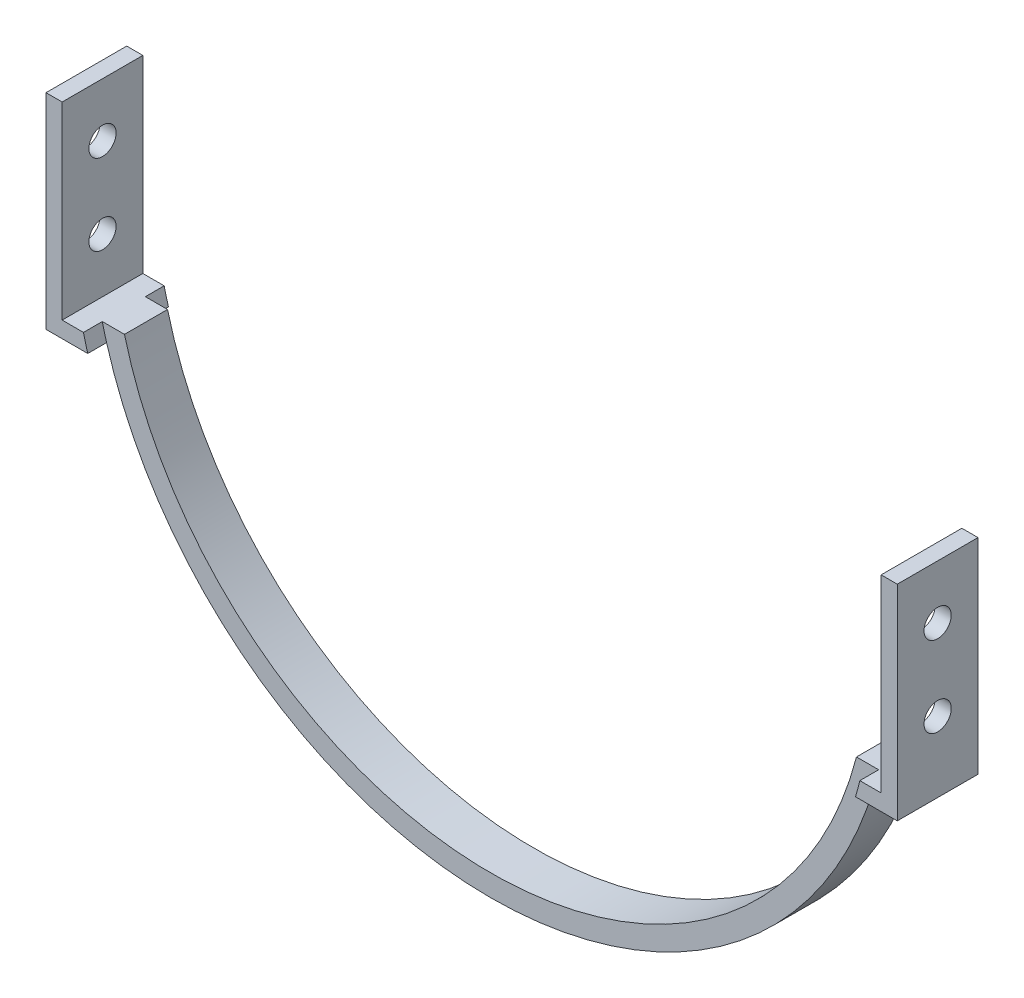
ISO-10303-21;
HEADER;
FILE_DESCRIPTION(('STEP AP214'),'2;1');
FILE_NAME('part.step','',(''),(''),'','','');
FILE_SCHEMA(('AUTOMOTIVE_DESIGN { 1 0 10303 214 1 1 1 1 }'));
ENDSEC;
DATA;
#1=APPLICATION_CONTEXT('core data for automotive mechanical design processes');
#2=APPLICATION_PROTOCOL_DEFINITION('international standard','automotive_design',2000,#1);
#3=PRODUCT_CONTEXT('',#1,'mechanical');
#4=PRODUCT('Part','Part','',(#3));
#5=PRODUCT_RELATED_PRODUCT_CATEGORY('part','',(#4));
#6=PRODUCT_DEFINITION_FORMATION('','',#4);
#7=PRODUCT_DEFINITION_CONTEXT('part definition',#1,'design');
#8=PRODUCT_DEFINITION('design','',#6,#7);
#9=PRODUCT_DEFINITION_SHAPE('','',#8);
#10=(LENGTH_UNIT() NAMED_UNIT(*) SI_UNIT(.MILLI.,.METRE.));
#11=(NAMED_UNIT(*) PLANE_ANGLE_UNIT() SI_UNIT($,.RADIAN.));
#12=(NAMED_UNIT(*) SI_UNIT($,.STERADIAN.) SOLID_ANGLE_UNIT());
#13=UNCERTAINTY_MEASURE_WITH_UNIT(LENGTH_MEASURE(1.E-05),#10,'distance_accuracy_value','');
#14=(GEOMETRIC_REPRESENTATION_CONTEXT(3) GLOBAL_UNCERTAINTY_ASSIGNED_CONTEXT((#13)) GLOBAL_UNIT_ASSIGNED_CONTEXT((#10,
#11,#12)) REPRESENTATION_CONTEXT('',''));
#15=CARTESIAN_POINT('',(0.,0.,0.));
#16=DIRECTION('',(0.,0.,1.));
#17=DIRECTION('',(1.,0.,0.));
#18=AXIS2_PLACEMENT_3D('',#15,#16,#17);
#19=CARTESIAN_POINT('',(-79.1,0.,7.5));
#20=DIRECTION('',(1.,0.,0.));
#21=DIRECTION('',(0.,0.,-1.));
#22=AXIS2_PLACEMENT_3D('',#19,#20,#21);
#23=PLANE('',#22);
#24=CARTESIAN_POINT('',(-79.1,7.5,0.));
#25=DIRECTION('',(-1.,0.,0.));
#26=DIRECTION('',(0.,0.,1.));
#27=AXIS2_PLACEMENT_3D('',#24,#25,#26);
#28=CIRCLE('',#27,2.5273);
#29=CARTESIAN_POINT('',(-79.1,7.5,2.5273));
#30=VERTEX_POINT('',#29);
#31=EDGE_CURVE('E367',#30,#30,#28,.T.);
#32=ORIENTED_EDGE('',*,*,#31,.F.);
#33=EDGE_LOOP('',(#32));
#34=FACE_BOUND('',#33,.T.);
#35=DIRECTION('',(0.,-1.,0.));
#36=VECTOR('',#35,1.);
#37=CARTESIAN_POINT('',(-79.1,0.,-7.5));
#38=LINE('',#37,#36);
#39=CARTESIAN_POINT('',(-79.1,17.5,-7.5));
#40=VERTEX_POINT('',#39);
#41=CARTESIAN_POINT('',(-79.1,-20.6,-7.5));
#42=VERTEX_POINT('',#41);
#43=EDGE_CURVE('E296',#40,#42,#38,.T.);
#44=ORIENTED_EDGE('',*,*,#43,.T.);
#45=DIRECTION('',(0.,0.,-1.));
#46=VECTOR('',#45,1.);
#47=CARTESIAN_POINT('',(-79.1,-20.6,7.5));
#48=LINE('',#47,#46);
#49=CARTESIAN_POINT('',(-79.1,-20.6,7.5));
#50=VERTEX_POINT('',#49);
#51=EDGE_CURVE('E306',#50,#42,#48,.T.);
#52=ORIENTED_EDGE('',*,*,#51,.F.);
#53=DIRECTION('',(0.,-1.,0.));
#54=VECTOR('',#53,1.);
#55=CARTESIAN_POINT('',(-79.1,0.,7.5));
#56=LINE('',#55,#54);
#57=CARTESIAN_POINT('',(-79.1,17.5,7.5));
#58=VERTEX_POINT('',#57);
#59=EDGE_CURVE('E277',#58,#50,#56,.T.);
#60=ORIENTED_EDGE('',*,*,#59,.F.);
#61=DIRECTION('',(0.,0.,-1.));
#62=VECTOR('',#61,1.);
#63=CARTESIAN_POINT('',(-79.1,17.5,7.5));
#64=LINE('',#63,#62);
#65=EDGE_CURVE('E311',#58,#40,#64,.T.);
#66=ORIENTED_EDGE('',*,*,#65,.T.);
#67=EDGE_LOOP('',(#44,#52,#60,#66));
#68=FACE_BOUND('',#67,.T.);
#69=CARTESIAN_POINT('',(-79.1,-7.5,0.));
#70=DIRECTION('',(-1.,0.,0.));
#71=DIRECTION('',(0.,0.,1.));
#72=AXIS2_PLACEMENT_3D('',#69,#70,#71);
#73=CIRCLE('',#72,2.5273);
#74=CARTESIAN_POINT('',(-79.1,-7.5,2.5273));
#75=VERTEX_POINT('',#74);
#76=EDGE_CURVE('E366',#75,#75,#73,.T.);
#77=ORIENTED_EDGE('',*,*,#76,.F.);
#78=EDGE_LOOP('',(#77));
#79=FACE_BOUND('',#78,.T.);
#80=ADVANCED_FACE('F49',(#34,#68,#79),#23,.F.);
#81=CARTESIAN_POINT('',(0.,0.,4.));
#82=DIRECTION('',(0.,0.,-1.));
#83=DIRECTION('',(-1.,0.,0.));
#84=AXIS2_PLACEMENT_3D('',#81,#82,#83);
#85=CYLINDRICAL_SURFACE('',#84,74.255);
#86=CARTESIAN_POINT('',(0.,0.,-4.));
#87=DIRECTION('',(0.,0.,1.));
#88=DIRECTION('',(1.,0.,0.));
#89=AXIS2_PLACEMENT_3D('',#86,#87,#88);
#90=CIRCLE('',#89,74.255);
#91=CARTESIAN_POINT('',(-71.3403464037006,-20.6,-4.));
#92=VERTEX_POINT('',#91);
#93=CARTESIAN_POINT('',(71.3403464037006,-20.6,-4.));
#94=VERTEX_POINT('',#93);
#95=EDGE_CURVE('E349',#92,#94,#90,.T.);
#96=ORIENTED_EDGE('',*,*,#95,.T.);
#97=DIRECTION('',(0.,0.,-1.));
#98=VECTOR('',#97,1.);
#99=CARTESIAN_POINT('',(71.3403464037006,-20.6,7.5));
#100=LINE('',#99,#98);
#101=CARTESIAN_POINT('',(71.3403464037006,-20.6,4.));
#102=VERTEX_POINT('',#101);
#103=EDGE_CURVE('E67',#102,#94,#100,.T.);
#104=ORIENTED_EDGE('',*,*,#103,.F.);
#105=CARTESIAN_POINT('',(0.,0.,4.));
#106=DIRECTION('',(0.,0.,1.));
#107=DIRECTION('',(1.,0.,0.));
#108=AXIS2_PLACEMENT_3D('',#105,#106,#107);
#109=CIRCLE('',#108,74.255);
#110=CARTESIAN_POINT('',(-71.3403464037006,-20.6,4.));
#111=VERTEX_POINT('',#110);
#112=EDGE_CURVE('E333',#111,#102,#109,.T.);
#113=ORIENTED_EDGE('',*,*,#112,.F.);
#114=DIRECTION('',(0.,0.,-1.));
#115=VECTOR('',#114,1.);
#116=CARTESIAN_POINT('',(-71.3403464037006,-20.6,7.5));
#117=LINE('',#116,#115);
#118=EDGE_CURVE('E307',#111,#92,#117,.T.);
#119=ORIENTED_EDGE('',*,*,#118,.T.);
#120=EDGE_LOOP('',(#96,#104,#113,#119));
#121=FACE_BOUND('',#120,.T.);
#122=ADVANCED_FACE('F51',(#121),#85,.T.);
#123=CARTESIAN_POINT('',(0.,-17.6,4.));
#124=DIRECTION('',(0.,-1.,0.));
#125=DIRECTION('',(0.,0.,-1.));
#126=AXIS2_PLACEMENT_3D('',#123,#124,#125);
#127=PLANE('',#126);
#128=DIRECTION('',(-1.,0.,0.));
#129=VECTOR('',#128,1.);
#130=CARTESIAN_POINT('',(0.,-17.6,-4.));
#131=LINE('',#130,#129);
#132=CARTESIAN_POINT('',(72.1390672590102,-17.6,-4.));
#133=VERTEX_POINT('',#132);
#134=CARTESIAN_POINT('',(68.0147412330591,-17.6,-4.));
#135=VERTEX_POINT('',#134);
#136=EDGE_CURVE('E348',#133,#135,#131,.T.);
#137=ORIENTED_EDGE('',*,*,#136,.T.);
#138=DIRECTION('',(0.,0.,-1.));
#139=VECTOR('',#138,1.);
#140=CARTESIAN_POINT('',(68.0147412330591,-17.6,4.));
#141=LINE('',#140,#139);
#142=CARTESIAN_POINT('',(68.0147412330591,-17.6,4.));
#143=VERTEX_POINT('',#142);
#144=EDGE_CURVE('E11',#143,#135,#141,.T.);
#145=ORIENTED_EDGE('',*,*,#144,.F.);
#146=DIRECTION('',(-1.,0.,0.));
#147=VECTOR('',#146,1.);
#148=CARTESIAN_POINT('',(0.,-17.6,4.));
#149=LINE('',#148,#147);
#150=CARTESIAN_POINT('',(72.1390672590102,-17.6,4.));
#151=VERTEX_POINT('',#150);
#152=EDGE_CURVE('E332',#151,#143,#149,.T.);
#153=ORIENTED_EDGE('',*,*,#152,.F.);
#154=DIRECTION('',(0.,0.,-1.));
#155=VECTOR('',#154,1.);
#156=CARTESIAN_POINT('',(72.1390672590102,-17.6,7.5));
#157=LINE('',#156,#155);
#158=CARTESIAN_POINT('',(72.1390672590102,-17.6,7.5));
#159=VERTEX_POINT('',#158);
#160=EDGE_CURVE('E246',#159,#151,#157,.T.);
#161=ORIENTED_EDGE('',*,*,#160,.F.);
#162=DIRECTION('',(1.,0.,0.));
#163=VECTOR('',#162,1.);
#164=CARTESIAN_POINT('',(0.,-17.6,7.5));
#165=LINE('',#164,#163);
#166=CARTESIAN_POINT('',(76.1,-17.6,7.5));
#167=VERTEX_POINT('',#166);
#168=EDGE_CURVE('E197',#159,#167,#165,.T.);
#169=ORIENTED_EDGE('',*,*,#168,.T.);
#170=DIRECTION('',(0.,0.,-1.));
#171=VECTOR('',#170,1.);
#172=CARTESIAN_POINT('',(76.1,-17.6,7.5));
#173=LINE('',#172,#171);
#174=CARTESIAN_POINT('',(76.1,-17.6,-7.5));
#175=VERTEX_POINT('',#174);
#176=EDGE_CURVE('E249',#167,#175,#173,.T.);
#177=ORIENTED_EDGE('',*,*,#176,.T.);
#178=DIRECTION('',(1.,0.,0.));
#179=VECTOR('',#178,1.);
#180=CARTESIAN_POINT('',(0.,-17.6,-7.5));
#181=LINE('',#180,#179);
#182=CARTESIAN_POINT('',(72.1390672590102,-17.6,-7.5));
#183=VERTEX_POINT('',#182);
#184=EDGE_CURVE('E199',#183,#175,#181,.T.);
#185=ORIENTED_EDGE('',*,*,#184,.F.);
#186=EDGE_CURVE('E221',#133,#183,#157,.T.);
#187=ORIENTED_EDGE('',*,*,#186,.F.);
#188=EDGE_LOOP('',(#137,#145,#153,#161,#169,#177,#185,#187));
#189=FACE_BOUND('',#188,.T.);
#190=ADVANCED_FACE('F419',(#189),#127,.F.);
#191=CARTESIAN_POINT('',(0.,0.,4.));
#192=DIRECTION('',(0.,0.,-1.));
#193=DIRECTION('',(-1.,0.,0.));
#194=AXIS2_PLACEMENT_3D('',#191,#192,#193);
#195=CYLINDRICAL_SURFACE('',#194,70.255);
#196=CARTESIAN_POINT('',(0.,0.,-4.));
#197=DIRECTION('',(0.,0.,1.));
#198=DIRECTION('',(1.,0.,0.));
#199=AXIS2_PLACEMENT_3D('',#196,#197,#198);
#200=CIRCLE('',#199,70.255);
#201=CARTESIAN_POINT('',(-68.0147412330592,-17.6,-4.));
#202=VERTEX_POINT('',#201);
#203=EDGE_CURVE('E353',#202,#135,#200,.T.);
#204=ORIENTED_EDGE('',*,*,#203,.F.);
#205=DIRECTION('',(0.,0.,-1.));
#206=VECTOR('',#205,1.);
#207=CARTESIAN_POINT('',(-68.0147412330592,-17.6,4.));
#208=LINE('',#207,#206);
#209=CARTESIAN_POINT('',(-68.0147412330592,-17.6,4.));
#210=VERTEX_POINT('',#209);
#211=EDGE_CURVE('E59',#210,#202,#208,.T.);
#212=ORIENTED_EDGE('',*,*,#211,.F.);
#213=CARTESIAN_POINT('',(0.,0.,4.));
#214=DIRECTION('',(0.,0.,1.));
#215=DIRECTION('',(1.,0.,0.));
#216=AXIS2_PLACEMENT_3D('',#213,#214,#215);
#217=CIRCLE('',#216,70.255);
#218=EDGE_CURVE('E336',#210,#143,#217,.T.);
#219=ORIENTED_EDGE('',*,*,#218,.T.);
#220=ORIENTED_EDGE('',*,*,#144,.T.);
#221=EDGE_LOOP('',(#204,#212,#219,#220));
#222=FACE_BOUND('',#221,.T.);
#223=ADVANCED_FACE('F447',(#222),#195,.F.);
#224=CARTESIAN_POINT('',(0.,-17.6,4.));
#225=DIRECTION('',(0.,1.,0.));
#226=DIRECTION('',(0.,0.,1.));
#227=AXIS2_PLACEMENT_3D('',#224,#225,#226);
#228=PLANE('',#227);
#229=DIRECTION('',(1.,0.,0.));
#230=VECTOR('',#229,1.);
#231=CARTESIAN_POINT('',(0.,-17.6,-4.));
#232=LINE('',#231,#230);
#233=CARTESIAN_POINT('',(-72.1390672590102,-17.6,-4.));
#234=VERTEX_POINT('',#233);
#235=EDGE_CURVE('E357',#234,#202,#232,.T.);
#236=ORIENTED_EDGE('',*,*,#235,.F.);
#237=DIRECTION('',(0.,0.,-1.));
#238=VECTOR('',#237,1.);
#239=CARTESIAN_POINT('',(-72.1390672590102,-17.6,7.5));
#240=LINE('',#239,#238);
#241=CARTESIAN_POINT('',(-72.1390672590102,-17.6,-7.5));
#242=VERTEX_POINT('',#241);
#243=EDGE_CURVE('E323',#234,#242,#240,.T.);
#244=ORIENTED_EDGE('',*,*,#243,.T.);
#245=DIRECTION('',(-1.,0.,0.));
#246=VECTOR('',#245,1.);
#247=CARTESIAN_POINT('',(0.,-17.6,-7.5));
#248=LINE('',#247,#246);
#249=CARTESIAN_POINT('',(-76.1,-17.6,-7.5));
#250=VERTEX_POINT('',#249);
#251=EDGE_CURVE('E287',#242,#250,#248,.T.);
#252=ORIENTED_EDGE('',*,*,#251,.T.);
#253=DIRECTION('',(0.,0.,-1.));
#254=VECTOR('',#253,1.);
#255=CARTESIAN_POINT('',(-76.1,-17.6,7.5));
#256=LINE('',#255,#254);
#257=CARTESIAN_POINT('',(-76.1,-17.6,7.5));
#258=VERTEX_POINT('',#257);
#259=EDGE_CURVE('E319',#258,#250,#256,.T.);
#260=ORIENTED_EDGE('',*,*,#259,.F.);
#261=DIRECTION('',(-1.,0.,0.));
#262=VECTOR('',#261,1.);
#263=CARTESIAN_POINT('',(0.,-17.6,7.5));
#264=LINE('',#263,#262);
#265=CARTESIAN_POINT('',(-72.1390672590102,-17.6,7.5));
#266=VERTEX_POINT('',#265);
#267=EDGE_CURVE('E267',#266,#258,#264,.T.);
#268=ORIENTED_EDGE('',*,*,#267,.F.);
#269=CARTESIAN_POINT('',(-72.1390672590102,-17.6,4.));
#270=VERTEX_POINT('',#269);
#271=EDGE_CURVE('E324',#266,#270,#240,.T.);
#272=ORIENTED_EDGE('',*,*,#271,.T.);
#273=DIRECTION('',(1.,0.,0.));
#274=VECTOR('',#273,1.);
#275=CARTESIAN_POINT('',(0.,-17.6,4.));
#276=LINE('',#275,#274);
#277=EDGE_CURVE('E340',#270,#210,#276,.T.);
#278=ORIENTED_EDGE('',*,*,#277,.T.);
#279=ORIENTED_EDGE('',*,*,#211,.T.);
#280=EDGE_LOOP('',(#236,#244,#252,#260,#268,#272,#278,#279));
#281=FACE_BOUND('',#280,.T.);
#282=ADVANCED_FACE('F441',(#281),#228,.T.);
#283=CARTESIAN_POINT('',(0.,0.,4.));
#284=DIRECTION('',(0.,0.,1.));
#285=DIRECTION('',(1.,0.,0.));
#286=AXIS2_PLACEMENT_3D('',#283,#284,#285);
#287=PLANE('',#286);
#288=EDGE_CURVE('E328',#270,#111,#109,.T.);
#289=ORIENTED_EDGE('',*,*,#288,.T.);
#290=ORIENTED_EDGE('',*,*,#112,.T.);
#291=CARTESIAN_POINT('',(0.,0.,4.));
#292=DIRECTION('',(0.,0.,1.));
#293=DIRECTION('',(1.,0.,0.));
#294=AXIS2_PLACEMENT_3D('',#291,#292,#293);
#295=CIRCLE('',#294,74.255);
#296=EDGE_CURVE('E183',#151,#102,#295,.F.);
#297=ORIENTED_EDGE('',*,*,#296,.F.);
#298=ORIENTED_EDGE('',*,*,#152,.T.);
#299=ORIENTED_EDGE('',*,*,#218,.F.);
#300=ORIENTED_EDGE('',*,*,#277,.F.);
#301=EDGE_LOOP('',(#289,#290,#297,#298,#299,#300));
#302=FACE_BOUND('',#301,.T.);
#303=ADVANCED_FACE('F437',(#302),#287,.T.);
#304=CARTESIAN_POINT('',(0.,0.,-4.));
#305=DIRECTION('',(0.,0.,1.));
#306=DIRECTION('',(1.,0.,0.));
#307=AXIS2_PLACEMENT_3D('',#304,#305,#306);
#308=PLANE('',#307);
#309=EDGE_CURVE('E344',#234,#92,#90,.T.);
#310=ORIENTED_EDGE('',*,*,#309,.F.);
#311=ORIENTED_EDGE('',*,*,#235,.T.);
#312=ORIENTED_EDGE('',*,*,#203,.T.);
#313=ORIENTED_EDGE('',*,*,#136,.F.);
#314=EDGE_CURVE('E75',#94,#133,#90,.T.);
#315=ORIENTED_EDGE('',*,*,#314,.F.);
#316=ORIENTED_EDGE('',*,*,#95,.F.);
#317=EDGE_LOOP('',(#310,#311,#312,#313,#315,#316));
#318=FACE_BOUND('',#317,.T.);
#319=ADVANCED_FACE('F440',(#318),#308,.F.);
#320=CARTESIAN_POINT('',(0.,0.,7.5));
#321=DIRECTION('',(0.,0.,-1.));
#322=DIRECTION('',(-1.,0.,0.));
#323=AXIS2_PLACEMENT_3D('',#320,#321,#322);
#324=CYLINDRICAL_SURFACE('',#323,74.255);
#325=ORIENTED_EDGE('',*,*,#309,.T.);
#326=CARTESIAN_POINT('',(-71.3403464037006,-20.6,-7.5));
#327=VERTEX_POINT('',#326);
#328=EDGE_CURVE('E283',#92,#327,#117,.T.);
#329=ORIENTED_EDGE('',*,*,#328,.T.);
#330=CARTESIAN_POINT('',(0.,0.,-7.5));
#331=DIRECTION('',(0.,0.,1.));
#332=DIRECTION('',(1.,0.,0.));
#333=AXIS2_PLACEMENT_3D('',#330,#331,#332);
#334=CIRCLE('',#333,74.255);
#335=EDGE_CURVE('E262',#242,#327,#334,.T.);
#336=ORIENTED_EDGE('',*,*,#335,.F.);
#337=ORIENTED_EDGE('',*,*,#243,.F.);
#338=EDGE_LOOP('',(#325,#329,#336,#337));
#339=FACE_BOUND('',#338,.T.);
#340=ADVANCED_FACE('F435',(#339),#324,.F.);
#341=CARTESIAN_POINT('',(-71.3403464037006,-20.6,7.5));
#342=VERTEX_POINT('',#341);
#343=EDGE_CURVE('E302',#342,#111,#117,.T.);
#344=ORIENTED_EDGE('',*,*,#343,.T.);
#345=ORIENTED_EDGE('',*,*,#288,.F.);
#346=ORIENTED_EDGE('',*,*,#271,.F.);
#347=CARTESIAN_POINT('',(0.,0.,7.5));
#348=DIRECTION('',(0.,0.,1.));
#349=DIRECTION('',(1.,0.,0.));
#350=AXIS2_PLACEMENT_3D('',#347,#348,#349);
#351=CIRCLE('',#350,74.255);
#352=EDGE_CURVE('E263',#266,#342,#351,.T.);
#353=ORIENTED_EDGE('',*,*,#352,.T.);
#354=EDGE_LOOP('',(#344,#345,#346,#353));
#355=FACE_BOUND('',#354,.T.);
#356=ADVANCED_FACE('F431',(#355),#324,.F.);
#357=CARTESIAN_POINT('',(-76.1,0.,7.5));
#358=DIRECTION('',(-1.,0.,0.));
#359=DIRECTION('',(0.,0.,1.));
#360=AXIS2_PLACEMENT_3D('',#357,#358,#359);
#361=PLANE('',#360);
#362=CARTESIAN_POINT('',(-76.1,7.5,0.));
#363=DIRECTION('',(-1.,0.,0.));
#364=DIRECTION('',(0.,0.,1.));
#365=AXIS2_PLACEMENT_3D('',#362,#363,#364);
#366=CIRCLE('',#365,2.5273);
#367=CARTESIAN_POINT('',(-76.1,7.5,2.5273));
#368=VERTEX_POINT('',#367);
#369=EDGE_CURVE('E363',#368,#368,#366,.T.);
#370=ORIENTED_EDGE('',*,*,#369,.T.);
#371=EDGE_LOOP('',(#370));
#372=FACE_BOUND('',#371,.T.);
#373=CARTESIAN_POINT('',(-76.1,-7.5,0.));
#374=DIRECTION('',(-1.,0.,0.));
#375=DIRECTION('',(0.,0.,1.));
#376=AXIS2_PLACEMENT_3D('',#373,#374,#375);
#377=CIRCLE('',#376,2.5273);
#378=CARTESIAN_POINT('',(-76.1,-7.5,2.5273));
#379=VERTEX_POINT('',#378);
#380=EDGE_CURVE('E227',#379,#379,#377,.T.);
#381=ORIENTED_EDGE('',*,*,#380,.T.);
#382=EDGE_LOOP('',(#381));
#383=FACE_BOUND('',#382,.T.);
#384=DIRECTION('',(0.,1.,0.));
#385=VECTOR('',#384,1.);
#386=CARTESIAN_POINT('',(-76.1,0.,-7.5));
#387=LINE('',#386,#385);
#388=CARTESIAN_POINT('',(-76.1,17.5,-7.5));
#389=VERTEX_POINT('',#388);
#390=EDGE_CURVE('E290',#250,#389,#387,.T.);
#391=ORIENTED_EDGE('',*,*,#390,.T.);
#392=DIRECTION('',(0.,0.,-1.));
#393=VECTOR('',#392,1.);
#394=CARTESIAN_POINT('',(-76.1,17.5,7.5));
#395=LINE('',#394,#393);
#396=CARTESIAN_POINT('',(-76.1,17.5,7.5));
#397=VERTEX_POINT('',#396);
#398=EDGE_CURVE('E315',#397,#389,#395,.T.);
#399=ORIENTED_EDGE('',*,*,#398,.F.);
#400=DIRECTION('',(0.,1.,0.));
#401=VECTOR('',#400,1.);
#402=CARTESIAN_POINT('',(-76.1,0.,7.5));
#403=LINE('',#402,#401);
#404=EDGE_CURVE('E271',#258,#397,#403,.T.);
#405=ORIENTED_EDGE('',*,*,#404,.F.);
#406=ORIENTED_EDGE('',*,*,#259,.T.);
#407=EDGE_LOOP('',(#391,#399,#405,#406));
#408=FACE_BOUND('',#407,.T.);
#409=ADVANCED_FACE('F393',(#372,#383,#408),#361,.F.);
#410=CARTESIAN_POINT('',(0.,17.5,7.5));
#411=DIRECTION('',(0.,-1.,0.));
#412=DIRECTION('',(0.,0.,-1.));
#413=AXIS2_PLACEMENT_3D('',#410,#411,#412);
#414=PLANE('',#413);
#415=DIRECTION('',(-1.,0.,0.));
#416=VECTOR('',#415,1.);
#417=CARTESIAN_POINT('',(0.,17.5,-7.5));
#418=LINE('',#417,#416);
#419=EDGE_CURVE('E293',#389,#40,#418,.T.);
#420=ORIENTED_EDGE('',*,*,#419,.T.);
#421=ORIENTED_EDGE('',*,*,#65,.F.);
#422=DIRECTION('',(-1.,0.,0.));
#423=VECTOR('',#422,1.);
#424=CARTESIAN_POINT('',(0.,17.5,7.5));
#425=LINE('',#424,#423);
#426=EDGE_CURVE('E274',#397,#58,#425,.T.);
#427=ORIENTED_EDGE('',*,*,#426,.F.);
#428=ORIENTED_EDGE('',*,*,#398,.T.);
#429=EDGE_LOOP('',(#420,#421,#427,#428));
#430=FACE_BOUND('',#429,.T.);
#431=ADVANCED_FACE('F426',(#430),#414,.F.);
#432=CARTESIAN_POINT('',(0.,-20.6,7.5));
#433=DIRECTION('',(0.,1.,0.));
#434=DIRECTION('',(0.,0.,1.));
#435=AXIS2_PLACEMENT_3D('',#432,#433,#434);
#436=PLANE('',#435);
#437=DIRECTION('',(1.,0.,0.));
#438=VECTOR('',#437,1.);
#439=CARTESIAN_POINT('',(0.,-20.6,-7.5));
#440=LINE('',#439,#438);
#441=EDGE_CURVE('E268',#42,#327,#440,.T.);
#442=ORIENTED_EDGE('',*,*,#441,.T.);
#443=ORIENTED_EDGE('',*,*,#328,.F.);
#444=ORIENTED_EDGE('',*,*,#118,.F.);
#445=ORIENTED_EDGE('',*,*,#343,.F.);
#446=DIRECTION('',(1.,0.,0.));
#447=VECTOR('',#446,1.);
#448=CARTESIAN_POINT('',(0.,-20.6,7.5));
#449=LINE('',#448,#447);
#450=EDGE_CURVE('E280',#50,#342,#449,.T.);
#451=ORIENTED_EDGE('',*,*,#450,.F.);
#452=ORIENTED_EDGE('',*,*,#51,.T.);
#453=EDGE_LOOP('',(#442,#443,#444,#445,#451,#452));
#454=FACE_BOUND('',#453,.T.);
#455=ADVANCED_FACE('F424',(#454),#436,.F.);
#456=CARTESIAN_POINT('',(0.,0.,7.5));
#457=DIRECTION('',(0.,0.,1.));
#458=DIRECTION('',(1.,0.,0.));
#459=AXIS2_PLACEMENT_3D('',#456,#457,#458);
#460=PLANE('',#459);
#461=ORIENTED_EDGE('',*,*,#352,.F.);
#462=ORIENTED_EDGE('',*,*,#267,.T.);
#463=ORIENTED_EDGE('',*,*,#404,.T.);
#464=ORIENTED_EDGE('',*,*,#426,.T.);
#465=ORIENTED_EDGE('',*,*,#59,.T.);
#466=ORIENTED_EDGE('',*,*,#450,.T.);
#467=EDGE_LOOP('',(#461,#462,#463,#464,#465,#466));
#468=FACE_BOUND('',#467,.T.);
#469=ADVANCED_FACE('F489',(#468),#460,.T.);
#470=CARTESIAN_POINT('',(0.,0.,-7.5));
#471=DIRECTION('',(0.,0.,1.));
#472=DIRECTION('',(1.,0.,0.));
#473=AXIS2_PLACEMENT_3D('',#470,#471,#472);
#474=PLANE('',#473);
#475=ORIENTED_EDGE('',*,*,#335,.T.);
#476=ORIENTED_EDGE('',*,*,#441,.F.);
#477=ORIENTED_EDGE('',*,*,#43,.F.);
#478=ORIENTED_EDGE('',*,*,#419,.F.);
#479=ORIENTED_EDGE('',*,*,#390,.F.);
#480=ORIENTED_EDGE('',*,*,#251,.F.);
#481=EDGE_LOOP('',(#475,#476,#477,#478,#479,#480));
#482=FACE_BOUND('',#481,.T.);
#483=ADVANCED_FACE('F482',(#482),#474,.F.);
#484=CARTESIAN_POINT('',(0.,0.,7.5));
#485=DIRECTION('',(0.,0.,-1.));
#486=DIRECTION('',(-1.,0.,0.));
#487=AXIS2_PLACEMENT_3D('',#484,#485,#486);
#488=CYLINDRICAL_SURFACE('',#487,74.255);
#489=ORIENTED_EDGE('',*,*,#314,.T.);
#490=ORIENTED_EDGE('',*,*,#186,.T.);
#491=CARTESIAN_POINT('',(0.,0.,-7.5));
#492=DIRECTION('',(0.,0.,1.));
#493=DIRECTION('',(1.,0.,0.));
#494=AXIS2_PLACEMENT_3D('',#491,#492,#493);
#495=CIRCLE('',#494,74.255);
#496=CARTESIAN_POINT('',(71.3403464037006,-20.6,-7.5));
#497=VERTEX_POINT('',#496);
#498=EDGE_CURVE('E222',#497,#183,#495,.T.);
#499=ORIENTED_EDGE('',*,*,#498,.F.);
#500=EDGE_CURVE('E188',#94,#497,#100,.T.);
#501=ORIENTED_EDGE('',*,*,#500,.F.);
#502=EDGE_LOOP('',(#489,#490,#499,#501));
#503=FACE_BOUND('',#502,.T.);
#504=ADVANCED_FACE('F500',(#503),#488,.F.);
#505=ORIENTED_EDGE('',*,*,#160,.T.);
#506=ORIENTED_EDGE('',*,*,#296,.T.);
#507=CARTESIAN_POINT('',(71.3403464037006,-20.6,7.5));
#508=VERTEX_POINT('',#507);
#509=EDGE_CURVE('E177',#508,#102,#100,.T.);
#510=ORIENTED_EDGE('',*,*,#509,.F.);
#511=CARTESIAN_POINT('',(0.,0.,7.5));
#512=DIRECTION('',(0.,0.,1.));
#513=DIRECTION('',(1.,0.,0.));
#514=AXIS2_PLACEMENT_3D('',#511,#512,#513);
#515=CIRCLE('',#514,74.255);
#516=EDGE_CURVE('E181',#508,#159,#515,.T.);
#517=ORIENTED_EDGE('',*,*,#516,.T.);
#518=EDGE_LOOP('',(#505,#506,#510,#517));
#519=FACE_BOUND('',#518,.T.);
#520=ADVANCED_FACE('F180',(#519),#488,.F.);
#521=CARTESIAN_POINT('',(0.,-20.6,7.5));
#522=DIRECTION('',(0.,-1.,0.));
#523=DIRECTION('',(0.,0.,-1.));
#524=AXIS2_PLACEMENT_3D('',#521,#522,#523);
#525=PLANE('',#524);
#526=DIRECTION('',(-1.,0.,0.));
#527=VECTOR('',#526,1.);
#528=CARTESIAN_POINT('',(0.,-20.6,-7.5));
#529=LINE('',#528,#527);
#530=CARTESIAN_POINT('',(79.1,-20.6,-7.5));
#531=VERTEX_POINT('',#530);
#532=EDGE_CURVE('E226',#531,#497,#529,.T.);
#533=ORIENTED_EDGE('',*,*,#532,.F.);
#534=DIRECTION('',(0.,0.,-1.));
#535=VECTOR('',#534,1.);
#536=CARTESIAN_POINT('',(79.1,-20.6,7.5));
#537=LINE('',#536,#535);
#538=CARTESIAN_POINT('',(79.1,-20.6,7.5));
#539=VERTEX_POINT('',#538);
#540=EDGE_CURVE('E203',#539,#531,#537,.T.);
#541=ORIENTED_EDGE('',*,*,#540,.F.);
#542=DIRECTION('',(-1.,0.,0.));
#543=VECTOR('',#542,1.);
#544=CARTESIAN_POINT('',(0.,-20.6,7.5));
#545=LINE('',#544,#543);
#546=EDGE_CURVE('E193',#539,#508,#545,.T.);
#547=ORIENTED_EDGE('',*,*,#546,.T.);
#548=ORIENTED_EDGE('',*,*,#509,.T.);
#549=ORIENTED_EDGE('',*,*,#103,.T.);
#550=ORIENTED_EDGE('',*,*,#500,.T.);
#551=EDGE_LOOP('',(#533,#541,#547,#548,#549,#550));
#552=FACE_BOUND('',#551,.T.);
#553=ADVANCED_FACE('F202',(#552),#525,.T.);
#554=CARTESIAN_POINT('',(79.1,0.,7.5));
#555=DIRECTION('',(1.,0.,0.));
#556=DIRECTION('',(0.,0.,-1.));
#557=AXIS2_PLACEMENT_3D('',#554,#555,#556);
#558=PLANE('',#557);
#559=CARTESIAN_POINT('',(79.1,7.5,0.));
#560=DIRECTION('',(1.,0.,0.));
#561=DIRECTION('',(0.,0.,-1.));
#562=AXIS2_PLACEMENT_3D('',#559,#560,#561);
#563=CIRCLE('',#562,2.5273);
#564=CARTESIAN_POINT('',(79.1,7.5,-2.5273));
#565=VERTEX_POINT('',#564);
#566=EDGE_CURVE('E384',#565,#565,#563,.T.);
#567=ORIENTED_EDGE('',*,*,#566,.F.);
#568=EDGE_LOOP('',(#567));
#569=FACE_BOUND('',#568,.T.);
#570=CARTESIAN_POINT('',(79.1,-7.5,0.));
#571=DIRECTION('',(1.,0.,0.));
#572=DIRECTION('',(0.,0.,-1.));
#573=AXIS2_PLACEMENT_3D('',#570,#571,#572);
#574=CIRCLE('',#573,2.5273);
#575=CARTESIAN_POINT('',(79.1,-7.5,-2.5273));
#576=VERTEX_POINT('',#575);
#577=EDGE_CURVE('E371',#576,#576,#574,.T.);
#578=ORIENTED_EDGE('',*,*,#577,.F.);
#579=EDGE_LOOP('',(#578));
#580=FACE_BOUND('',#579,.T.);
#581=DIRECTION('',(0.,-1.,0.));
#582=VECTOR('',#581,1.);
#583=CARTESIAN_POINT('',(79.1,0.,-7.5));
#584=LINE('',#583,#582);
#585=CARTESIAN_POINT('',(79.1,17.5,-7.5));
#586=VERTEX_POINT('',#585);
#587=EDGE_CURVE('E231',#586,#531,#584,.T.);
#588=ORIENTED_EDGE('',*,*,#587,.F.);
#589=DIRECTION('',(0.,0.,-1.));
#590=VECTOR('',#589,1.);
#591=CARTESIAN_POINT('',(79.1,17.5,7.5));
#592=LINE('',#591,#590);
#593=CARTESIAN_POINT('',(79.1,17.5,7.5));
#594=VERTEX_POINT('',#593);
#595=EDGE_CURVE('E255',#594,#586,#592,.T.);
#596=ORIENTED_EDGE('',*,*,#595,.F.);
#597=DIRECTION('',(0.,-1.,0.));
#598=VECTOR('',#597,1.);
#599=CARTESIAN_POINT('',(79.1,0.,7.5));
#600=LINE('',#599,#598);
#601=EDGE_CURVE('E205',#594,#539,#600,.T.);
#602=ORIENTED_EDGE('',*,*,#601,.T.);
#603=ORIENTED_EDGE('',*,*,#540,.T.);
#604=EDGE_LOOP('',(#588,#596,#602,#603));
#605=FACE_BOUND('',#604,.T.);
#606=ADVANCED_FACE('F506',(#569,#580,#605),#558,.T.);
#607=CARTESIAN_POINT('',(0.,17.5,7.5));
#608=DIRECTION('',(0.,1.,0.));
#609=DIRECTION('',(0.,0.,1.));
#610=AXIS2_PLACEMENT_3D('',#607,#608,#609);
#611=PLANE('',#610);
#612=DIRECTION('',(1.,0.,0.));
#613=VECTOR('',#612,1.);
#614=CARTESIAN_POINT('',(0.,17.5,-7.5));
#615=LINE('',#614,#613);
#616=CARTESIAN_POINT('',(76.1,17.5,-7.5));
#617=VERTEX_POINT('',#616);
#618=EDGE_CURVE('E235',#617,#586,#615,.T.);
#619=ORIENTED_EDGE('',*,*,#618,.F.);
#620=DIRECTION('',(0.,0.,-1.));
#621=VECTOR('',#620,1.);
#622=CARTESIAN_POINT('',(76.1,17.5,7.5));
#623=LINE('',#622,#621);
#624=CARTESIAN_POINT('',(76.1,17.5,7.5));
#625=VERTEX_POINT('',#624);
#626=EDGE_CURVE('E252',#625,#617,#623,.T.);
#627=ORIENTED_EDGE('',*,*,#626,.F.);
#628=DIRECTION('',(1.,0.,0.));
#629=VECTOR('',#628,1.);
#630=CARTESIAN_POINT('',(0.,17.5,7.5));
#631=LINE('',#630,#629);
#632=EDGE_CURVE('E208',#625,#594,#631,.T.);
#633=ORIENTED_EDGE('',*,*,#632,.T.);
#634=ORIENTED_EDGE('',*,*,#595,.T.);
#635=EDGE_LOOP('',(#619,#627,#633,#634));
#636=FACE_BOUND('',#635,.T.);
#637=ADVANCED_FACE('F509',(#636),#611,.T.);
#638=CARTESIAN_POINT('',(76.1,0.,7.5));
#639=DIRECTION('',(-1.,0.,0.));
#640=DIRECTION('',(0.,0.,1.));
#641=AXIS2_PLACEMENT_3D('',#638,#639,#640);
#642=PLANE('',#641);
#643=CARTESIAN_POINT('',(76.1,7.5,0.));
#644=DIRECTION('',(-1.,0.,0.));
#645=DIRECTION('',(0.,0.,1.));
#646=AXIS2_PLACEMENT_3D('',#643,#644,#645);
#647=CIRCLE('',#646,2.5273);
#648=CARTESIAN_POINT('',(76.1,7.5,2.5273));
#649=VERTEX_POINT('',#648);
#650=EDGE_CURVE('E53',#649,#649,#647,.T.);
#651=ORIENTED_EDGE('',*,*,#650,.F.);
#652=EDGE_LOOP('',(#651));
#653=FACE_BOUND('',#652,.T.);
#654=CARTESIAN_POINT('',(76.1,-7.5,0.));
#655=DIRECTION('',(-1.,0.,0.));
#656=DIRECTION('',(0.,0.,1.));
#657=AXIS2_PLACEMENT_3D('',#654,#655,#656);
#658=CIRCLE('',#657,2.5273);
#659=CARTESIAN_POINT('',(76.1,-7.5,2.5273));
#660=VERTEX_POINT('',#659);
#661=EDGE_CURVE('E368',#660,#660,#658,.T.);
#662=ORIENTED_EDGE('',*,*,#661,.F.);
#663=EDGE_LOOP('',(#662));
#664=FACE_BOUND('',#663,.T.);
#665=DIRECTION('',(0.,1.,0.));
#666=VECTOR('',#665,1.);
#667=CARTESIAN_POINT('',(76.1,0.,-7.5));
#668=LINE('',#667,#666);
#669=EDGE_CURVE('E239',#175,#617,#668,.T.);
#670=ORIENTED_EDGE('',*,*,#669,.F.);
#671=ORIENTED_EDGE('',*,*,#176,.F.);
#672=DIRECTION('',(0.,1.,0.));
#673=VECTOR('',#672,1.);
#674=CARTESIAN_POINT('',(76.1,0.,7.5));
#675=LINE('',#674,#673);
#676=EDGE_CURVE('E215',#167,#625,#675,.T.);
#677=ORIENTED_EDGE('',*,*,#676,.T.);
#678=ORIENTED_EDGE('',*,*,#626,.T.);
#679=EDGE_LOOP('',(#670,#671,#677,#678));
#680=FACE_BOUND('',#679,.T.);
#681=ADVANCED_FACE('F513',(#653,#664,#680),#642,.T.);
#682=CARTESIAN_POINT('',(0.,0.,7.5));
#683=DIRECTION('',(0.,0.,1.));
#684=DIRECTION('',(1.,0.,0.));
#685=AXIS2_PLACEMENT_3D('',#682,#683,#684);
#686=PLANE('',#685);
#687=ORIENTED_EDGE('',*,*,#516,.F.);
#688=ORIENTED_EDGE('',*,*,#546,.F.);
#689=ORIENTED_EDGE('',*,*,#601,.F.);
#690=ORIENTED_EDGE('',*,*,#632,.F.);
#691=ORIENTED_EDGE('',*,*,#676,.F.);
#692=ORIENTED_EDGE('',*,*,#168,.F.);
#693=EDGE_LOOP('',(#687,#688,#689,#690,#691,#692));
#694=FACE_BOUND('',#693,.T.);
#695=ADVANCED_FACE('F191',(#694),#686,.T.);
#696=CARTESIAN_POINT('',(0.,0.,-7.5));
#697=DIRECTION('',(0.,0.,1.));
#698=DIRECTION('',(1.,0.,0.));
#699=AXIS2_PLACEMENT_3D('',#696,#697,#698);
#700=PLANE('',#699);
#701=ORIENTED_EDGE('',*,*,#498,.T.);
#702=ORIENTED_EDGE('',*,*,#184,.T.);
#703=ORIENTED_EDGE('',*,*,#669,.T.);
#704=ORIENTED_EDGE('',*,*,#618,.T.);
#705=ORIENTED_EDGE('',*,*,#587,.T.);
#706=ORIENTED_EDGE('',*,*,#532,.T.);
#707=EDGE_LOOP('',(#701,#702,#703,#704,#705,#706));
#708=FACE_BOUND('',#707,.T.);
#709=ADVANCED_FACE('F399',(#708),#700,.F.);
#710=CARTESIAN_POINT('',(-79.1,-7.5,0.));
#711=DIRECTION('',(-1.,0.,0.));
#712=DIRECTION('',(0.,0.,1.));
#713=AXIS2_PLACEMENT_3D('',#710,#711,#712);
#714=CYLINDRICAL_SURFACE('',#713,2.5273);
#715=ORIENTED_EDGE('',*,*,#76,.T.);
#716=EDGE_LOOP('',(#715));
#717=FACE_BOUND('',#716,.T.);
#718=ORIENTED_EDGE('',*,*,#380,.F.);
#719=EDGE_LOOP('',(#718));
#720=FACE_BOUND('',#719,.T.);
#721=ADVANCED_FACE('F396',(#717,#720),#714,.F.);
#722=CARTESIAN_POINT('',(-79.1,7.5,0.));
#723=DIRECTION('',(-1.,0.,0.));
#724=DIRECTION('',(0.,0.,1.));
#725=AXIS2_PLACEMENT_3D('',#722,#723,#724);
#726=CYLINDRICAL_SURFACE('',#725,2.5273);
#727=ORIENTED_EDGE('',*,*,#31,.T.);
#728=EDGE_LOOP('',(#727));
#729=FACE_BOUND('',#728,.T.);
#730=ORIENTED_EDGE('',*,*,#369,.F.);
#731=EDGE_LOOP('',(#730));
#732=FACE_BOUND('',#731,.T.);
#733=ADVANCED_FACE('F398',(#729,#732),#726,.F.);
#734=CARTESIAN_POINT('',(79.1,-7.5,0.));
#735=DIRECTION('',(1.,0.,0.));
#736=DIRECTION('',(0.,0.,-1.));
#737=AXIS2_PLACEMENT_3D('',#734,#735,#736);
#738=CYLINDRICAL_SURFACE('',#737,2.5273);
#739=ORIENTED_EDGE('',*,*,#661,.T.);
#740=EDGE_LOOP('',(#739));
#741=FACE_BOUND('',#740,.T.);
#742=ORIENTED_EDGE('',*,*,#577,.T.);
#743=EDGE_LOOP('',(#742));
#744=FACE_BOUND('',#743,.T.);
#745=ADVANCED_FACE('F406',(#741,#744),#738,.F.);
#746=CARTESIAN_POINT('',(79.1,7.5,0.));
#747=DIRECTION('',(1.,0.,0.));
#748=DIRECTION('',(0.,0.,-1.));
#749=AXIS2_PLACEMENT_3D('',#746,#747,#748);
#750=CYLINDRICAL_SURFACE('',#749,2.5273);
#751=ORIENTED_EDGE('',*,*,#650,.T.);
#752=EDGE_LOOP('',(#751));
#753=FACE_BOUND('',#752,.T.);
#754=ORIENTED_EDGE('',*,*,#566,.T.);
#755=EDGE_LOOP('',(#754));
#756=FACE_BOUND('',#755,.T.);
#757=ADVANCED_FACE('F552',(#753,#756),#750,.F.);
#758=CLOSED_SHELL('',(#80,#122,#190,#223,#282,#303,#319,#340,#356,#409,#431,#455,#469,#483,#504,
#520,#553,#606,#637,#681,#695,#709,#721,#733,#745,#757));
#759=MANIFOLD_SOLID_BREP('B2',#758);
#760=ADVANCED_BREP_SHAPE_REPRESENTATION('',(#18,#759),#14);
#761=SHAPE_DEFINITION_REPRESENTATION(#9,#760);
ENDSEC;
END-ISO-10303-21;
